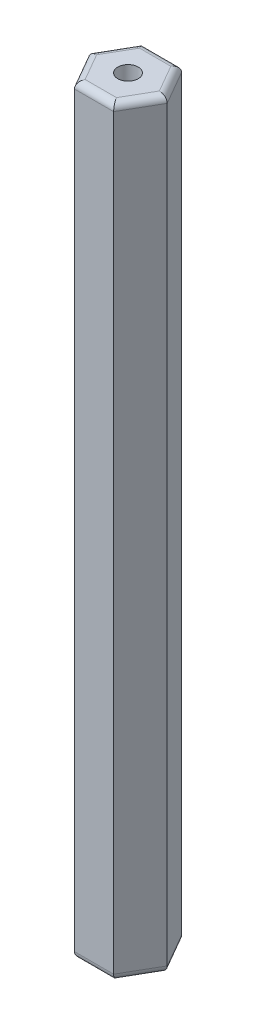
ISO-10303-21;
HEADER;
FILE_DESCRIPTION(('STEP AP214'),'2;1');
FILE_NAME('part.step','',(''),(''),'','','');
FILE_SCHEMA(('AUTOMOTIVE_DESIGN { 1 0 10303 214 1 1 1 1 }'));
ENDSEC;
DATA;
#1=APPLICATION_CONTEXT('core data for automotive mechanical design processes');
#2=APPLICATION_PROTOCOL_DEFINITION('international standard','automotive_design',2000,#1);
#3=PRODUCT_CONTEXT('',#1,'mechanical');
#4=PRODUCT('Part','Part','',(#3));
#5=PRODUCT_RELATED_PRODUCT_CATEGORY('part','',(#4));
#6=PRODUCT_DEFINITION_FORMATION('','',#4);
#7=PRODUCT_DEFINITION_CONTEXT('part definition',#1,'design');
#8=PRODUCT_DEFINITION('design','',#6,#7);
#9=PRODUCT_DEFINITION_SHAPE('','',#8);
#10=(LENGTH_UNIT() NAMED_UNIT(*) SI_UNIT(.MILLI.,.METRE.));
#11=(NAMED_UNIT(*) PLANE_ANGLE_UNIT() SI_UNIT($,.RADIAN.));
#12=(NAMED_UNIT(*) SI_UNIT($,.STERADIAN.) SOLID_ANGLE_UNIT());
#13=UNCERTAINTY_MEASURE_WITH_UNIT(LENGTH_MEASURE(1.E-05),#10,'distance_accuracy_value','');
#14=(GEOMETRIC_REPRESENTATION_CONTEXT(3) GLOBAL_UNCERTAINTY_ASSIGNED_CONTEXT((#13)) GLOBAL_UNIT_ASSIGNED_CONTEXT((#10,
#11,#12)) REPRESENTATION_CONTEXT('',''));
#15=CARTESIAN_POINT('',(0.,0.,0.));
#16=DIRECTION('',(0.,0.,1.));
#17=DIRECTION('',(1.,0.,0.));
#18=AXIS2_PLACEMENT_3D('',#15,#16,#17);
#19=CARTESIAN_POINT('',(-2.88675134594812,26.,0.));
#20=DIRECTION('',(-0.866025403784439,0.,-0.5));
#21=DIRECTION('',(-0.5,0.,0.866025403784439));
#22=AXIS2_PLACEMENT_3D('',#19,#20,#21);
#23=PLANE('',#22);
#24=DIRECTION('',(0.,-1.,0.));
#25=VECTOR('',#24,1.);
#26=CARTESIAN_POINT('',(-1.44337567297406,26.,-2.5));
#27=LINE('',#26,#25);
#28=CARTESIAN_POINT('',(-1.44337567297406,25.5,-2.5));
#29=VERTEX_POINT('',#28);
#30=CARTESIAN_POINT('',(-1.44337567297406,-29.5,-2.5));
#31=VERTEX_POINT('',#30);
#32=EDGE_CURVE('E157',#29,#31,#27,.T.);
#33=ORIENTED_EDGE('',*,*,#32,.T.);
#34=DIRECTION('',(0.5,0.,-0.866025403784439));
#35=VECTOR('',#34,1.);
#36=CARTESIAN_POINT('',(-2.88675134594812,-29.5,0.));
#37=LINE('',#36,#35);
#38=CARTESIAN_POINT('',(-2.88675134594812,-29.5,0.));
#39=VERTEX_POINT('',#38);
#40=EDGE_CURVE('E154',#31,#39,#37,.F.);
#41=ORIENTED_EDGE('',*,*,#40,.T.);
#42=DIRECTION('',(0.,-1.,0.));
#43=VECTOR('',#42,1.);
#44=CARTESIAN_POINT('',(-2.88675134594812,26.,0.));
#45=LINE('',#44,#43);
#46=CARTESIAN_POINT('',(-2.88675134594812,25.5,0.));
#47=VERTEX_POINT('',#46);
#48=EDGE_CURVE('E151',#47,#39,#45,.T.);
#49=ORIENTED_EDGE('',*,*,#48,.F.);
#50=DIRECTION('',(0.5,0.,-0.866025403784439));
#51=VECTOR('',#50,1.);
#52=CARTESIAN_POINT('',(-1.44337567297406,25.5,-2.5));
#53=LINE('',#52,#51);
#54=EDGE_CURVE('E211',#47,#29,#53,.T.);
#55=ORIENTED_EDGE('',*,*,#54,.T.);
#56=EDGE_LOOP('',(#33,#41,#49,#55));
#57=FACE_BOUND('',#56,.T.);
#58=ADVANCED_FACE('F37',(#57),#23,.T.);
#59=CARTESIAN_POINT('',(-1.44337567297406,26.,2.5));
#60=DIRECTION('',(-0.866025403784439,0.,0.5));
#61=DIRECTION('',(0.5,0.,0.866025403784439));
#62=AXIS2_PLACEMENT_3D('',#59,#60,#61);
#63=PLANE('',#62);
#64=ORIENTED_EDGE('',*,*,#48,.T.);
#65=DIRECTION('',(-0.5,0.,-0.866025403784439));
#66=VECTOR('',#65,1.);
#67=CARTESIAN_POINT('',(-1.44337567297406,-29.5,2.5));
#68=LINE('',#67,#66);
#69=CARTESIAN_POINT('',(-1.44337567297406,-29.5,2.5));
#70=VERTEX_POINT('',#69);
#71=EDGE_CURVE('E196',#39,#70,#68,.F.);
#72=ORIENTED_EDGE('',*,*,#71,.T.);
#73=DIRECTION('',(0.,-1.,0.));
#74=VECTOR('',#73,1.);
#75=CARTESIAN_POINT('',(-1.44337567297406,26.,2.5));
#76=LINE('',#75,#74);
#77=CARTESIAN_POINT('',(-1.44337567297406,25.5,2.5));
#78=VERTEX_POINT('',#77);
#79=EDGE_CURVE('E260',#78,#70,#76,.T.);
#80=ORIENTED_EDGE('',*,*,#79,.F.);
#81=DIRECTION('',(-0.5,0.,-0.866025403784439));
#82=VECTOR('',#81,1.);
#83=CARTESIAN_POINT('',(-2.88675134594812,25.5,0.));
#84=LINE('',#83,#82);
#85=EDGE_CURVE('E202',#78,#47,#84,.T.);
#86=ORIENTED_EDGE('',*,*,#85,.T.);
#87=EDGE_LOOP('',(#64,#72,#80,#86));
#88=FACE_BOUND('',#87,.T.);
#89=ADVANCED_FACE('F289',(#88),#63,.T.);
#90=CARTESIAN_POINT('',(1.44337567297406,26.,2.49999999999999));
#91=DIRECTION('',(0.,0.,1.));
#92=DIRECTION('',(1.,0.,0.));
#93=AXIS2_PLACEMENT_3D('',#90,#91,#92);
#94=PLANE('',#93);
#95=ORIENTED_EDGE('',*,*,#79,.T.);
#96=DIRECTION('',(-1.,0.,0.));
#97=VECTOR('',#96,1.);
#98=CARTESIAN_POINT('',(1.44337567297406,-29.5,2.49999999999999));
#99=LINE('',#98,#97);
#100=CARTESIAN_POINT('',(1.44337567297406,-29.5,2.49999999999999));
#101=VERTEX_POINT('',#100);
#102=EDGE_CURVE('E236',#70,#101,#99,.F.);
#103=ORIENTED_EDGE('',*,*,#102,.T.);
#104=DIRECTION('',(0.,-1.,0.));
#105=VECTOR('',#104,1.);
#106=CARTESIAN_POINT('',(1.44337567297406,26.,2.49999999999999));
#107=LINE('',#106,#105);
#108=CARTESIAN_POINT('',(1.44337567297406,25.5,2.49999999999999));
#109=VERTEX_POINT('',#108);
#110=EDGE_CURVE('E258',#109,#101,#107,.T.);
#111=ORIENTED_EDGE('',*,*,#110,.F.);
#112=DIRECTION('',(-1.,0.,0.));
#113=VECTOR('',#112,1.);
#114=CARTESIAN_POINT('',(-1.44337567297406,25.5,2.5));
#115=LINE('',#114,#113);
#116=EDGE_CURVE('E239',#109,#78,#115,.T.);
#117=ORIENTED_EDGE('',*,*,#116,.T.);
#118=EDGE_LOOP('',(#95,#103,#111,#117));
#119=FACE_BOUND('',#118,.T.);
#120=ADVANCED_FACE('F295',(#119),#94,.T.);
#121=CARTESIAN_POINT('',(2.88675134594812,26.,0.));
#122=DIRECTION('',(0.866025403784438,0.,0.500000000000001));
#123=DIRECTION('',(0.500000000000001,0.,-0.866025403784438));
#124=AXIS2_PLACEMENT_3D('',#121,#122,#123);
#125=PLANE('',#124);
#126=ORIENTED_EDGE('',*,*,#110,.T.);
#127=DIRECTION('',(-0.500000000000001,0.,0.866025403784438));
#128=VECTOR('',#127,1.);
#129=CARTESIAN_POINT('',(2.88675134594812,-29.5,0.));
#130=LINE('',#129,#128);
#131=CARTESIAN_POINT('',(2.88675134594812,-29.5,0.));
#132=VERTEX_POINT('',#131);
#133=EDGE_CURVE('E206',#101,#132,#130,.F.);
#134=ORIENTED_EDGE('',*,*,#133,.T.);
#135=DIRECTION('',(0.,-1.,0.));
#136=VECTOR('',#135,1.);
#137=CARTESIAN_POINT('',(2.88675134594812,26.,0.));
#138=LINE('',#137,#136);
#139=CARTESIAN_POINT('',(2.88675134594812,25.5,0.));
#140=VERTEX_POINT('',#139);
#141=EDGE_CURVE('E255',#140,#132,#138,.T.);
#142=ORIENTED_EDGE('',*,*,#141,.F.);
#143=DIRECTION('',(-0.500000000000001,0.,0.866025403784438));
#144=VECTOR('',#143,1.);
#145=CARTESIAN_POINT('',(1.44337567297406,25.5,2.49999999999999));
#146=LINE('',#145,#144);
#147=EDGE_CURVE('E231',#140,#109,#146,.T.);
#148=ORIENTED_EDGE('',*,*,#147,.T.);
#149=EDGE_LOOP('',(#126,#134,#142,#148));
#150=FACE_BOUND('',#149,.T.);
#151=ADVANCED_FACE('F344',(#150),#125,.T.);
#152=CARTESIAN_POINT('',(1.44337567297406,26.,-2.49999999999999));
#153=DIRECTION('',(0.866025403784438,0.,-0.500000000000001));
#154=DIRECTION('',(-0.500000000000001,0.,-0.866025403784438));
#155=AXIS2_PLACEMENT_3D('',#152,#153,#154);
#156=PLANE('',#155);
#157=ORIENTED_EDGE('',*,*,#141,.T.);
#158=DIRECTION('',(0.500000000000001,0.,0.866025403784438));
#159=VECTOR('',#158,1.);
#160=CARTESIAN_POINT('',(1.44337567297406,-29.5,-2.49999999999999));
#161=LINE('',#160,#159);
#162=CARTESIAN_POINT('',(1.44337567297406,-29.5,-2.49999999999999));
#163=VERTEX_POINT('',#162);
#164=EDGE_CURVE('E204',#132,#163,#161,.F.);
#165=ORIENTED_EDGE('',*,*,#164,.T.);
#166=DIRECTION('',(0.,-1.,0.));
#167=VECTOR('',#166,1.);
#168=CARTESIAN_POINT('',(1.44337567297406,26.,-2.49999999999999));
#169=LINE('',#168,#167);
#170=CARTESIAN_POINT('',(1.44337567297406,25.5,-2.49999999999999));
#171=VERTEX_POINT('',#170);
#172=EDGE_CURVE('E252',#171,#163,#169,.T.);
#173=ORIENTED_EDGE('',*,*,#172,.F.);
#174=DIRECTION('',(0.500000000000001,0.,0.866025403784438));
#175=VECTOR('',#174,1.);
#176=CARTESIAN_POINT('',(2.88675134594812,25.5,0.));
#177=LINE('',#176,#175);
#178=EDGE_CURVE('E201',#171,#140,#177,.T.);
#179=ORIENTED_EDGE('',*,*,#178,.T.);
#180=EDGE_LOOP('',(#157,#165,#173,#179));
#181=FACE_BOUND('',#180,.T.);
#182=ADVANCED_FACE('F346',(#181),#156,.T.);
#183=CARTESIAN_POINT('',(-1.44337567297406,26.,-2.5));
#184=DIRECTION('',(0.,0.,-1.));
#185=DIRECTION('',(-1.,0.,0.));
#186=AXIS2_PLACEMENT_3D('',#183,#184,#185);
#187=PLANE('',#186);
#188=ORIENTED_EDGE('',*,*,#172,.T.);
#189=DIRECTION('',(1.,0.,0.));
#190=VECTOR('',#189,1.);
#191=CARTESIAN_POINT('',(-1.44337567297406,-29.5,-2.5));
#192=LINE('',#191,#190);
#193=EDGE_CURVE('E216',#163,#31,#192,.F.);
#194=ORIENTED_EDGE('',*,*,#193,.T.);
#195=ORIENTED_EDGE('',*,*,#32,.F.);
#196=DIRECTION('',(1.,0.,0.));
#197=VECTOR('',#196,1.);
#198=CARTESIAN_POINT('',(1.44337567297406,25.5,-2.49999999999999));
#199=LINE('',#198,#197);
#200=EDGE_CURVE('E214',#29,#171,#199,.T.);
#201=ORIENTED_EDGE('',*,*,#200,.T.);
#202=EDGE_LOOP('',(#188,#194,#195,#201));
#203=FACE_BOUND('',#202,.T.);
#204=ADVANCED_FACE('F285',(#203),#187,.T.);
#205=CARTESIAN_POINT('',(0.,26.,0.));
#206=DIRECTION('',(0.,-1.,0.));
#207=DIRECTION('',(0.,0.,-1.));
#208=AXIS2_PLACEMENT_3D('',#205,#206,#207);
#209=PLANE('',#208);
#210=CARTESIAN_POINT('',(0.,26.,0.));
#211=DIRECTION('',(0.,-1.,0.));
#212=DIRECTION('',(0.,0.,-1.));
#213=AXIS2_PLACEMENT_3D('',#210,#211,#212);
#214=CIRCLE('',#213,0.751353761872901);
#215=CARTESIAN_POINT('',(0.,26.,-0.751353761872901));
#216=VERTEX_POINT('',#215);
#217=EDGE_CURVE('E166',#216,#216,#214,.T.);
#218=ORIENTED_EDGE('',*,*,#217,.T.);
#219=EDGE_LOOP('',(#218));
#220=FACE_BOUND('',#219,.T.);
#221=DIRECTION('',(-0.5,0.,-0.866025403784439));
#222=VECTOR('',#221,1.);
#223=CARTESIAN_POINT('',(-1.01036297108184,26.,2.25));
#224=LINE('',#223,#222);
#225=CARTESIAN_POINT('',(-2.3094010767585,26.,0.));
#226=VERTEX_POINT('',#225);
#227=CARTESIAN_POINT('',(-1.15470053837925,26.,1.99999999999999));
#228=VERTEX_POINT('',#227);
#229=EDGE_CURVE('E61',#226,#228,#224,.F.);
#230=ORIENTED_EDGE('',*,*,#229,.T.);
#231=DIRECTION('',(-1.,0.,0.));
#232=VECTOR('',#231,1.);
#233=CARTESIAN_POINT('',(1.44337567297406,26.,1.99999999999999));
#234=LINE('',#233,#232);
#235=CARTESIAN_POINT('',(1.15470053837925,26.,1.99999999999999));
#236=VERTEX_POINT('',#235);
#237=EDGE_CURVE('E11',#228,#236,#234,.F.);
#238=ORIENTED_EDGE('',*,*,#237,.T.);
#239=DIRECTION('',(-0.500000000000001,0.,0.866025403784438));
#240=VECTOR('',#239,1.);
#241=CARTESIAN_POINT('',(2.45373864405591,26.,-0.25));
#242=LINE('',#241,#240);
#243=CARTESIAN_POINT('',(2.3094010767585,26.,0.));
#244=VERTEX_POINT('',#243);
#245=EDGE_CURVE('E46',#236,#244,#242,.F.);
#246=ORIENTED_EDGE('',*,*,#245,.T.);
#247=DIRECTION('',(0.500000000000001,0.,0.866025403784438));
#248=VECTOR('',#247,1.);
#249=CARTESIAN_POINT('',(1.01036297108184,26.,-2.24999999999999));
#250=LINE('',#249,#248);
#251=CARTESIAN_POINT('',(1.15470053837925,26.,-1.99999999999999));
#252=VERTEX_POINT('',#251);
#253=EDGE_CURVE('E222',#244,#252,#250,.F.);
#254=ORIENTED_EDGE('',*,*,#253,.T.);
#255=DIRECTION('',(1.,0.,0.));
#256=VECTOR('',#255,1.);
#257=CARTESIAN_POINT('',(-1.44337567297406,26.,-2.));
#258=LINE('',#257,#256);
#259=CARTESIAN_POINT('',(-1.15470053837925,26.,-1.99999999999999));
#260=VERTEX_POINT('',#259);
#261=EDGE_CURVE('E218',#252,#260,#258,.F.);
#262=ORIENTED_EDGE('',*,*,#261,.T.);
#263=DIRECTION('',(0.5,0.,-0.866025403784439));
#264=VECTOR('',#263,1.);
#265=CARTESIAN_POINT('',(-2.4537386440559,26.,0.25));
#266=LINE('',#265,#264);
#267=EDGE_CURVE('E220',#260,#226,#266,.F.);
#268=ORIENTED_EDGE('',*,*,#267,.T.);
#269=EDGE_LOOP('',(#230,#238,#246,#254,#262,#268));
#270=FACE_BOUND('',#269,.T.);
#271=ADVANCED_FACE('F224',(#220,#270),#209,.F.);
#272=CARTESIAN_POINT('',(0.,-30.,0.));
#273=DIRECTION('',(0.,-1.,0.));
#274=DIRECTION('',(0.,0.,-1.));
#275=AXIS2_PLACEMENT_3D('',#272,#273,#274);
#276=PLANE('',#275);
#277=CARTESIAN_POINT('',(0.,-30.,0.));
#278=DIRECTION('',(0.,-1.,0.));
#279=DIRECTION('',(0.,0.,-1.));
#280=AXIS2_PLACEMENT_3D('',#277,#278,#279);
#281=CIRCLE('',#280,0.751353761872901);
#282=CARTESIAN_POINT('',(0.,-30.,-0.751353761872901));
#283=VERTEX_POINT('',#282);
#284=EDGE_CURVE('E263',#283,#283,#281,.T.);
#285=ORIENTED_EDGE('',*,*,#284,.F.);
#286=EDGE_LOOP('',(#285));
#287=FACE_BOUND('',#286,.T.);
#288=DIRECTION('',(-0.500000000000001,0.,0.866025403784438));
#289=VECTOR('',#288,1.);
#290=CARTESIAN_POINT('',(1.73205080756887,-30.,0.999999999999999));
#291=LINE('',#290,#289);
#292=CARTESIAN_POINT('',(2.3094010767585,-30.,0.));
#293=VERTEX_POINT('',#292);
#294=CARTESIAN_POINT('',(1.15470053837925,-30.,1.99999999999999));
#295=VERTEX_POINT('',#294);
#296=EDGE_CURVE('E246',#293,#295,#291,.T.);
#297=ORIENTED_EDGE('',*,*,#296,.T.);
#298=DIRECTION('',(-1.,0.,0.));
#299=VECTOR('',#298,1.);
#300=CARTESIAN_POINT('',(0.,-30.,1.99999999999999));
#301=LINE('',#300,#299);
#302=CARTESIAN_POINT('',(-1.15470053837925,-30.,1.99999999999999));
#303=VERTEX_POINT('',#302);
#304=EDGE_CURVE('E244',#295,#303,#301,.T.);
#305=ORIENTED_EDGE('',*,*,#304,.T.);
#306=DIRECTION('',(-0.5,0.,-0.866025403784439));
#307=VECTOR('',#306,1.);
#308=CARTESIAN_POINT('',(-1.73205080756887,-30.,0.999999999999998));
#309=LINE('',#308,#307);
#310=CARTESIAN_POINT('',(-2.3094010767585,-30.,0.));
#311=VERTEX_POINT('',#310);
#312=EDGE_CURVE('E135',#303,#311,#309,.T.);
#313=ORIENTED_EDGE('',*,*,#312,.T.);
#314=DIRECTION('',(0.5,0.,-0.866025403784439));
#315=VECTOR('',#314,1.);
#316=CARTESIAN_POINT('',(-1.73205080756887,-30.,-0.999999999999998));
#317=LINE('',#316,#315);
#318=CARTESIAN_POINT('',(-1.15470053837925,-30.,-1.99999999999999));
#319=VERTEX_POINT('',#318);
#320=EDGE_CURVE('E128',#311,#319,#317,.T.);
#321=ORIENTED_EDGE('',*,*,#320,.T.);
#322=DIRECTION('',(1.,0.,0.));
#323=VECTOR('',#322,1.);
#324=CARTESIAN_POINT('',(0.,-30.,-1.99999999999999));
#325=LINE('',#324,#323);
#326=CARTESIAN_POINT('',(1.15470053837925,-30.,-1.99999999999999));
#327=VERTEX_POINT('',#326);
#328=EDGE_CURVE('E131',#319,#327,#325,.T.);
#329=ORIENTED_EDGE('',*,*,#328,.T.);
#330=DIRECTION('',(0.500000000000001,0.,0.866025403784438));
#331=VECTOR('',#330,1.);
#332=CARTESIAN_POINT('',(1.73205080756887,-30.,-0.999999999999999));
#333=LINE('',#332,#331);
#334=EDGE_CURVE('E140',#327,#293,#333,.T.);
#335=ORIENTED_EDGE('',*,*,#334,.T.);
#336=EDGE_LOOP('',(#297,#305,#313,#321,#329,#335));
#337=FACE_BOUND('',#336,.T.);
#338=ADVANCED_FACE('F130',(#287,#337),#276,.T.);
#339=CARTESIAN_POINT('',(0.,-29.5,-1.99999999999999));
#340=DIRECTION('',(1.,0.,0.));
#341=DIRECTION('',(0.,0.,-1.));
#342=AXIS2_PLACEMENT_3D('',#339,#340,#341);
#343=CYLINDRICAL_SURFACE('',#342,0.5);
#344=CARTESIAN_POINT('',(-1.15470053837925,-29.5,-1.99999999999999));
#345=DIRECTION('',(0.866025403784439,0.,-0.499999999999999));
#346=DIRECTION('',(0.499999999999999,0.,0.866025403784439));
#347=AXIS2_PLACEMENT_3D('',#344,#345,#346);
#348=ELLIPSE('',#347,0.577350269189626,0.5);
#349=EDGE_CURVE('E146',#31,#319,#348,.F.);
#350=ORIENTED_EDGE('',*,*,#349,.F.);
#351=ORIENTED_EDGE('',*,*,#193,.F.);
#352=CARTESIAN_POINT('',(1.15470053837925,-29.5,-1.99999999999999));
#353=DIRECTION('',(0.866025403784439,0.,0.5));
#354=DIRECTION('',(0.5,0.,-0.866025403784439));
#355=AXIS2_PLACEMENT_3D('',#352,#353,#354);
#356=ELLIPSE('',#355,0.577350269189626,0.5);
#357=EDGE_CURVE('E149',#327,#163,#356,.T.);
#358=ORIENTED_EDGE('',*,*,#357,.F.);
#359=ORIENTED_EDGE('',*,*,#328,.F.);
#360=EDGE_LOOP('',(#350,#351,#358,#359));
#361=FACE_BOUND('',#360,.T.);
#362=ADVANCED_FACE('F144',(#361),#343,.T.);
#363=CARTESIAN_POINT('',(1.73205080756887,-29.5,-0.999999999999999));
#364=DIRECTION('',(0.500000000000001,0.,0.866025403784438));
#365=DIRECTION('',(0.866025403784438,0.,-0.500000000000001));
#366=AXIS2_PLACEMENT_3D('',#363,#364,#365);
#367=CYLINDRICAL_SURFACE('',#366,0.5);
#368=ORIENTED_EDGE('',*,*,#357,.T.);
#369=ORIENTED_EDGE('',*,*,#164,.F.);
#370=CARTESIAN_POINT('',(2.3094010767585,-29.5,0.));
#371=DIRECTION('',(0.,0.,1.));
#372=DIRECTION('',(1.,0.,0.));
#373=AXIS2_PLACEMENT_3D('',#370,#371,#372);
#374=ELLIPSE('',#373,0.577350269189626,0.5);
#375=EDGE_CURVE('E155',#293,#132,#374,.T.);
#376=ORIENTED_EDGE('',*,*,#375,.F.);
#377=ORIENTED_EDGE('',*,*,#334,.F.);
#378=EDGE_LOOP('',(#368,#369,#376,#377));
#379=FACE_BOUND('',#378,.T.);
#380=ADVANCED_FACE('F283',(#379),#367,.T.);
#381=CARTESIAN_POINT('',(-1.73205080756887,-29.5,-0.999999999999998));
#382=DIRECTION('',(0.5,0.,-0.866025403784439));
#383=DIRECTION('',(-0.866025403784439,0.,-0.5));
#384=AXIS2_PLACEMENT_3D('',#381,#382,#383);
#385=CYLINDRICAL_SURFACE('',#384,0.5);
#386=ORIENTED_EDGE('',*,*,#349,.T.);
#387=ORIENTED_EDGE('',*,*,#320,.F.);
#388=CARTESIAN_POINT('',(-2.3094010767585,-29.5,0.));
#389=DIRECTION('',(0.,0.,-1.));
#390=DIRECTION('',(1.,0.,0.));
#391=AXIS2_PLACEMENT_3D('',#388,#389,#390);
#392=ELLIPSE('',#391,0.577350269189626,0.5);
#393=EDGE_CURVE('E160',#39,#311,#392,.F.);
#394=ORIENTED_EDGE('',*,*,#393,.F.);
#395=ORIENTED_EDGE('',*,*,#40,.F.);
#396=EDGE_LOOP('',(#386,#387,#394,#395));
#397=FACE_BOUND('',#396,.T.);
#398=ADVANCED_FACE('F153',(#397),#385,.T.);
#399=CARTESIAN_POINT('',(1.73205080756887,-29.5,0.999999999999999));
#400=DIRECTION('',(-0.500000000000001,0.,0.866025403784438));
#401=DIRECTION('',(0.866025403784438,0.,0.500000000000001));
#402=AXIS2_PLACEMENT_3D('',#399,#400,#401);
#403=CYLINDRICAL_SURFACE('',#402,0.5);
#404=ORIENTED_EDGE('',*,*,#375,.T.);
#405=ORIENTED_EDGE('',*,*,#133,.F.);
#406=CARTESIAN_POINT('',(1.15470053837925,-29.5,1.99999999999999));
#407=DIRECTION('',(-0.866025403784439,0.,0.5));
#408=DIRECTION('',(0.5,0.,0.866025403784439));
#409=AXIS2_PLACEMENT_3D('',#406,#407,#408);
#410=ELLIPSE('',#409,0.577350269189626,0.5);
#411=EDGE_CURVE('E185',#295,#101,#410,.T.);
#412=ORIENTED_EDGE('',*,*,#411,.F.);
#413=ORIENTED_EDGE('',*,*,#296,.F.);
#414=EDGE_LOOP('',(#404,#405,#412,#413));
#415=FACE_BOUND('',#414,.T.);
#416=ADVANCED_FACE('F304',(#415),#403,.T.);
#417=CARTESIAN_POINT('',(-1.73205080756887,-29.5,0.999999999999998));
#418=DIRECTION('',(-0.5,0.,-0.866025403784439));
#419=DIRECTION('',(-0.866025403784439,0.,0.5));
#420=AXIS2_PLACEMENT_3D('',#417,#418,#419);
#421=CYLINDRICAL_SURFACE('',#420,0.5);
#422=ORIENTED_EDGE('',*,*,#393,.T.);
#423=ORIENTED_EDGE('',*,*,#312,.F.);
#424=CARTESIAN_POINT('',(-1.15470053837925,-29.5,1.99999999999999));
#425=DIRECTION('',(-0.866025403784439,0.,-0.499999999999999));
#426=DIRECTION('',(0.499999999999999,0.,-0.866025403784439));
#427=AXIS2_PLACEMENT_3D('',#424,#425,#426);
#428=ELLIPSE('',#427,0.577350269189626,0.5);
#429=EDGE_CURVE('E180',#70,#303,#428,.F.);
#430=ORIENTED_EDGE('',*,*,#429,.F.);
#431=ORIENTED_EDGE('',*,*,#71,.F.);
#432=EDGE_LOOP('',(#422,#423,#430,#431));
#433=FACE_BOUND('',#432,.T.);
#434=ADVANCED_FACE('F195',(#433),#421,.T.);
#435=CARTESIAN_POINT('',(0.,-29.5,1.99999999999999));
#436=DIRECTION('',(-1.,0.,0.));
#437=DIRECTION('',(0.,0.,1.));
#438=AXIS2_PLACEMENT_3D('',#435,#436,#437);
#439=CYLINDRICAL_SURFACE('',#438,0.5);
#440=ORIENTED_EDGE('',*,*,#411,.T.);
#441=ORIENTED_EDGE('',*,*,#102,.F.);
#442=ORIENTED_EDGE('',*,*,#429,.T.);
#443=ORIENTED_EDGE('',*,*,#304,.F.);
#444=EDGE_LOOP('',(#440,#441,#442,#443));
#445=FACE_BOUND('',#444,.T.);
#446=ADVANCED_FACE('F299',(#445),#439,.T.);
#447=CARTESIAN_POINT('',(-1.44337567297406,25.5,-2.));
#448=DIRECTION('',(-1.,0.,0.));
#449=DIRECTION('',(0.,0.,1.));
#450=AXIS2_PLACEMENT_3D('',#447,#448,#449);
#451=CYLINDRICAL_SURFACE('',#450,0.5);
#452=CARTESIAN_POINT('',(-1.15470053837925,25.5,-1.99999999999999));
#453=DIRECTION('',(-0.866025403784439,0.,0.499999999999999));
#454=DIRECTION('',(-0.499999999999999,0.,-0.866025403784439));
#455=AXIS2_PLACEMENT_3D('',#452,#453,#454);
#456=ELLIPSE('',#455,0.577350269189626,0.5);
#457=EDGE_CURVE('E173',#260,#29,#456,.T.);
#458=ORIENTED_EDGE('',*,*,#457,.F.);
#459=ORIENTED_EDGE('',*,*,#261,.F.);
#460=CARTESIAN_POINT('',(1.15470053837925,25.5,-1.99999999999999));
#461=DIRECTION('',(-0.866025403784439,0.,-0.5));
#462=DIRECTION('',(-0.5,0.,0.866025403784439));
#463=AXIS2_PLACEMENT_3D('',#460,#461,#462);
#464=ELLIPSE('',#463,0.577350269189626,0.5);
#465=EDGE_CURVE('E41',#171,#252,#464,.F.);
#466=ORIENTED_EDGE('',*,*,#465,.F.);
#467=ORIENTED_EDGE('',*,*,#200,.F.);
#468=EDGE_LOOP('',(#458,#459,#466,#467));
#469=FACE_BOUND('',#468,.T.);
#470=ADVANCED_FACE('F39',(#469),#451,.T.);
#471=CARTESIAN_POINT('',(1.01036297108184,25.5,-2.24999999999999));
#472=DIRECTION('',(-0.500000000000001,0.,-0.866025403784438));
#473=DIRECTION('',(-0.866025403784438,0.,0.500000000000001));
#474=AXIS2_PLACEMENT_3D('',#471,#472,#473);
#475=CYLINDRICAL_SURFACE('',#474,0.5);
#476=ORIENTED_EDGE('',*,*,#465,.T.);
#477=ORIENTED_EDGE('',*,*,#253,.F.);
#478=CARTESIAN_POINT('',(2.3094010767585,25.5,0.));
#479=DIRECTION('',(0.,0.,-1.));
#480=DIRECTION('',(-1.,0.,0.));
#481=AXIS2_PLACEMENT_3D('',#478,#479,#480);
#482=ELLIPSE('',#481,0.577350269189626,0.5);
#483=EDGE_CURVE('E171',#140,#244,#482,.F.);
#484=ORIENTED_EDGE('',*,*,#483,.F.);
#485=ORIENTED_EDGE('',*,*,#178,.F.);
#486=EDGE_LOOP('',(#476,#477,#484,#485));
#487=FACE_BOUND('',#486,.T.);
#488=ADVANCED_FACE('F228',(#487),#475,.T.);
#489=CARTESIAN_POINT('',(-2.4537386440559,25.5,0.25));
#490=DIRECTION('',(-0.5,0.,0.866025403784439));
#491=DIRECTION('',(0.866025403784439,0.,0.5));
#492=AXIS2_PLACEMENT_3D('',#489,#490,#491);
#493=CYLINDRICAL_SURFACE('',#492,0.5);
#494=ORIENTED_EDGE('',*,*,#457,.T.);
#495=ORIENTED_EDGE('',*,*,#54,.F.);
#496=CARTESIAN_POINT('',(-2.3094010767585,25.5,0.));
#497=DIRECTION('',(0.,0.,1.));
#498=DIRECTION('',(-1.,0.,0.));
#499=AXIS2_PLACEMENT_3D('',#496,#497,#498);
#500=ELLIPSE('',#499,0.577350269189626,0.5);
#501=EDGE_CURVE('E168',#226,#47,#500,.T.);
#502=ORIENTED_EDGE('',*,*,#501,.F.);
#503=ORIENTED_EDGE('',*,*,#267,.F.);
#504=EDGE_LOOP('',(#494,#495,#502,#503));
#505=FACE_BOUND('',#504,.T.);
#506=ADVANCED_FACE('F321',(#505),#493,.T.);
#507=CARTESIAN_POINT('',(2.45373864405591,25.5,-0.25));
#508=DIRECTION('',(0.500000000000001,0.,-0.866025403784438));
#509=DIRECTION('',(-0.866025403784438,0.,-0.500000000000001));
#510=AXIS2_PLACEMENT_3D('',#507,#508,#509);
#511=CYLINDRICAL_SURFACE('',#510,0.5);
#512=ORIENTED_EDGE('',*,*,#483,.T.);
#513=ORIENTED_EDGE('',*,*,#245,.F.);
#514=CARTESIAN_POINT('',(1.15470053837925,25.5,1.99999999999999));
#515=DIRECTION('',(0.866025403784439,0.,-0.5));
#516=DIRECTION('',(-0.5,0.,-0.866025403784439));
#517=AXIS2_PLACEMENT_3D('',#514,#515,#516);
#518=ELLIPSE('',#517,0.577350269189626,0.5);
#519=EDGE_CURVE('E54',#109,#236,#518,.F.);
#520=ORIENTED_EDGE('',*,*,#519,.F.);
#521=ORIENTED_EDGE('',*,*,#147,.F.);
#522=EDGE_LOOP('',(#512,#513,#520,#521));
#523=FACE_BOUND('',#522,.T.);
#524=ADVANCED_FACE('F230',(#523),#511,.T.);
#525=CARTESIAN_POINT('',(-1.01036297108184,25.5,2.25));
#526=DIRECTION('',(0.5,0.,0.866025403784439));
#527=DIRECTION('',(0.866025403784439,0.,-0.5));
#528=AXIS2_PLACEMENT_3D('',#525,#526,#527);
#529=CYLINDRICAL_SURFACE('',#528,0.5);
#530=ORIENTED_EDGE('',*,*,#501,.T.);
#531=ORIENTED_EDGE('',*,*,#85,.F.);
#532=CARTESIAN_POINT('',(-1.15470053837925,25.5,1.99999999999999));
#533=DIRECTION('',(0.866025403784439,0.,0.499999999999999));
#534=DIRECTION('',(-0.499999999999999,0.,0.866025403784439));
#535=AXIS2_PLACEMENT_3D('',#532,#533,#534);
#536=ELLIPSE('',#535,0.577350269189626,0.5);
#537=EDGE_CURVE('E164',#228,#78,#536,.T.);
#538=ORIENTED_EDGE('',*,*,#537,.F.);
#539=ORIENTED_EDGE('',*,*,#229,.F.);
#540=EDGE_LOOP('',(#530,#531,#538,#539));
#541=FACE_BOUND('',#540,.T.);
#542=ADVANCED_FACE('F315',(#541),#529,.T.);
#543=CARTESIAN_POINT('',(1.44337567297406,25.5,1.99999999999999));
#544=DIRECTION('',(1.,0.,0.));
#545=DIRECTION('',(0.,0.,-1.));
#546=AXIS2_PLACEMENT_3D('',#543,#544,#545);
#547=CYLINDRICAL_SURFACE('',#546,0.5);
#548=ORIENTED_EDGE('',*,*,#519,.T.);
#549=ORIENTED_EDGE('',*,*,#237,.F.);
#550=ORIENTED_EDGE('',*,*,#537,.T.);
#551=ORIENTED_EDGE('',*,*,#116,.F.);
#552=EDGE_LOOP('',(#548,#549,#550,#551));
#553=FACE_BOUND('',#552,.T.);
#554=ADVANCED_FACE('F273',(#553),#547,.T.);
#555=CARTESIAN_POINT('',(0.,26.,0.));
#556=DIRECTION('',(0.,-1.,0.));
#557=DIRECTION('',(0.,0.,-1.));
#558=AXIS2_PLACEMENT_3D('',#555,#556,#557);
#559=CYLINDRICAL_SURFACE('',#558,0.751353761872901);
#560=ORIENTED_EDGE('',*,*,#217,.F.);
#561=EDGE_LOOP('',(#560));
#562=FACE_BOUND('',#561,.T.);
#563=ORIENTED_EDGE('',*,*,#284,.T.);
#564=EDGE_LOOP('',(#563));
#565=FACE_BOUND('',#564,.T.);
#566=ADVANCED_FACE('F270',(#562,#565),#559,.F.);
#567=CLOSED_SHELL('',(#58,#89,#120,#151,#182,#204,#271,#338,#362,#380,#398,#416,#434,#446,#470,
#488,#506,#524,#542,#554,#566));
#568=MANIFOLD_SOLID_BREP('B2',#567);
#569=ADVANCED_BREP_SHAPE_REPRESENTATION('',(#18,#568),#14);
#570=SHAPE_DEFINITION_REPRESENTATION(#9,#569);
ENDSEC;
END-ISO-10303-21;
